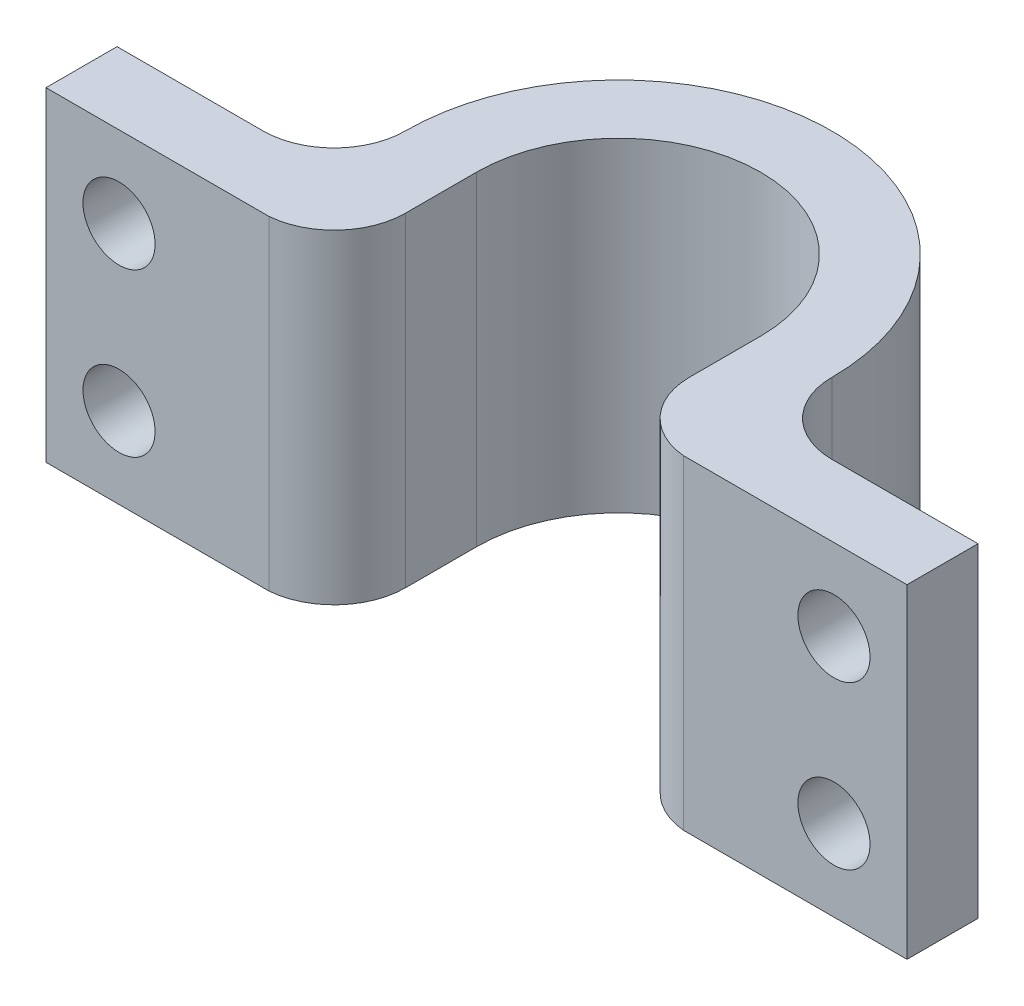
ISO-10303-21;
HEADER;
FILE_DESCRIPTION(('STEP AP214'),'2;1');
FILE_NAME('part.step','',(''),(''),'','','');
FILE_SCHEMA(('AUTOMOTIVE_DESIGN { 1 0 10303 214 1 1 1 1 }'));
ENDSEC;
DATA;
#1=APPLICATION_CONTEXT('core data for automotive mechanical design processes');
#2=APPLICATION_PROTOCOL_DEFINITION('international standard','automotive_design',2000,#1);
#3=PRODUCT_CONTEXT('',#1,'mechanical');
#4=PRODUCT('Part','Part','',(#3));
#5=PRODUCT_RELATED_PRODUCT_CATEGORY('part','',(#4));
#6=PRODUCT_DEFINITION_FORMATION('','',#4);
#7=PRODUCT_DEFINITION_CONTEXT('part definition',#1,'design');
#8=PRODUCT_DEFINITION('design','',#6,#7);
#9=PRODUCT_DEFINITION_SHAPE('','',#8);
#10=(LENGTH_UNIT() NAMED_UNIT(*) SI_UNIT(.MILLI.,.METRE.));
#11=(NAMED_UNIT(*) PLANE_ANGLE_UNIT() SI_UNIT($,.RADIAN.));
#12=(NAMED_UNIT(*) SI_UNIT($,.STERADIAN.) SOLID_ANGLE_UNIT());
#13=UNCERTAINTY_MEASURE_WITH_UNIT(LENGTH_MEASURE(1.E-05),#10,'distance_accuracy_value','');
#14=(GEOMETRIC_REPRESENTATION_CONTEXT(3) GLOBAL_UNCERTAINTY_ASSIGNED_CONTEXT((#13)) GLOBAL_UNIT_ASSIGNED_CONTEXT((#10,
#11,#12)) REPRESENTATION_CONTEXT('',''));
#15=CARTESIAN_POINT('',(0.,0.,0.));
#16=DIRECTION('',(0.,0.,1.));
#17=DIRECTION('',(1.,0.,0.));
#18=AXIS2_PLACEMENT_3D('',#15,#16,#17);
#19=CARTESIAN_POINT('',(-2.95941394430367,6.75,0.926754933966115));
#20=DIRECTION('',(0.,-1.,0.));
#21=DIRECTION('',(0.,0.,-1.));
#22=AXIS2_PLACEMENT_3D('',#19,#20,#21);
#23=CYLINDRICAL_SURFACE('',#22,0.988839731619867);
#24=CARTESIAN_POINT('',(-2.95941394430367,2.25,0.926754933966115));
#25=DIRECTION('',(0.,1.,0.));
#26=DIRECTION('',(0.,0.,-1.));
#27=AXIS2_PLACEMENT_3D('',#24,#25,#26);
#28=CIRCLE('',#27,0.988839731619867);
#29=CARTESIAN_POINT('',(-2.87704444821188,2.25,1.91215803977796));
#30=VERTEX_POINT('',#29);
#31=CARTESIAN_POINT('',(-1.9705742126838,2.25,0.926754933966115));
#32=VERTEX_POINT('',#31);
#33=EDGE_CURVE('E168',#30,#32,#28,.T.);
#34=ORIENTED_EDGE('',*,*,#33,.T.);
#35=DIRECTION('',(0.,-1.,0.));
#36=VECTOR('',#35,1.);
#37=CARTESIAN_POINT('',(-1.9705742126838,6.75,0.926754933966115));
#38=LINE('',#37,#36);
#39=CARTESIAN_POINT('',(-1.9705742126838,6.75,0.926754933966115));
#40=VERTEX_POINT('',#39);
#41=EDGE_CURVE('E11',#40,#32,#38,.T.);
#42=ORIENTED_EDGE('',*,*,#41,.F.);
#43=CARTESIAN_POINT('',(-2.95941394430367,6.75,0.926754933966115));
#44=DIRECTION('',(0.,1.,0.));
#45=DIRECTION('',(0.,0.,-1.));
#46=AXIS2_PLACEMENT_3D('',#43,#44,#45);
#47=CIRCLE('',#46,0.988839731619867);
#48=CARTESIAN_POINT('',(-2.87704444821188,6.75,1.91215803977796));
#49=VERTEX_POINT('',#48);
#50=EDGE_CURVE('E195',#49,#40,#47,.T.);
#51=ORIENTED_EDGE('',*,*,#50,.F.);
#52=DIRECTION('',(0.,-1.,0.));
#53=VECTOR('',#52,1.);
#54=CARTESIAN_POINT('',(-2.87704444821188,6.75,1.91215803977796));
#55=LINE('',#54,#53);
#56=EDGE_CURVE('E164',#49,#30,#55,.T.);
#57=ORIENTED_EDGE('',*,*,#56,.T.);
#58=EDGE_LOOP('',(#34,#42,#51,#57));
#59=FACE_BOUND('',#58,.T.);
#60=ADVANCED_FACE('F34',(#59),#23,.T.);
#61=CARTESIAN_POINT('',(-1.9705742126838,6.75,-0.0586481718457327));
#62=DIRECTION('',(-1.,0.,0.));
#63=DIRECTION('',(0.,0.,1.));
#64=AXIS2_PLACEMENT_3D('',#61,#62,#63);
#65=PLANE('',#64);
#66=DIRECTION('',(0.,0.,-1.));
#67=VECTOR('',#66,1.);
#68=CARTESIAN_POINT('',(-1.9705742126838,2.25,-0.0586481718457327));
#69=LINE('',#68,#67);
#70=CARTESIAN_POINT('',(-1.9705742126838,2.25,-0.0586481718457331));
#71=VERTEX_POINT('',#70);
#72=EDGE_CURVE('E171',#32,#71,#69,.T.);
#73=ORIENTED_EDGE('',*,*,#72,.T.);
#74=DIRECTION('',(0.,-1.,0.));
#75=VECTOR('',#74,1.);
#76=CARTESIAN_POINT('',(-1.9705742126838,6.75,-0.0586481718457331));
#77=LINE('',#76,#75);
#78=CARTESIAN_POINT('',(-1.9705742126838,6.75,-0.0586481718457331));
#79=VERTEX_POINT('',#78);
#80=EDGE_CURVE('E43',#79,#71,#77,.T.);
#81=ORIENTED_EDGE('',*,*,#80,.F.);
#82=DIRECTION('',(0.,0.,-1.));
#83=VECTOR('',#82,1.);
#84=CARTESIAN_POINT('',(-1.9705742126838,6.75,-0.0586481718457327));
#85=LINE('',#84,#83);
#86=EDGE_CURVE('E113',#40,#79,#85,.T.);
#87=ORIENTED_EDGE('',*,*,#86,.F.);
#88=ORIENTED_EDGE('',*,*,#41,.T.);
#89=EDGE_LOOP('',(#73,#81,#87,#88));
#90=FACE_BOUND('',#89,.T.);
#91=ADVANCED_FACE('F293',(#90),#65,.F.);
#92=CARTESIAN_POINT('',(-0.000574212683799921,6.75,-0.0586481718457327));
#93=DIRECTION('',(0.,-1.,0.));
#94=DIRECTION('',(0.,0.,-1.));
#95=AXIS2_PLACEMENT_3D('',#92,#93,#94);
#96=CYLINDRICAL_SURFACE('',#95,1.97);
#97=CARTESIAN_POINT('',(-0.000574212683799921,2.25,-0.0586481718457327));
#98=DIRECTION('',(0.,-1.,0.));
#99=DIRECTION('',(0.,0.,1.));
#100=AXIS2_PLACEMENT_3D('',#97,#98,#99);
#101=CIRCLE('',#100,1.97);
#102=CARTESIAN_POINT('',(1.9694257873162,2.25,-0.0586481718457327));
#103=VERTEX_POINT('',#102);
#104=EDGE_CURVE('E174',#71,#103,#101,.T.);
#105=ORIENTED_EDGE('',*,*,#104,.T.);
#106=DIRECTION('',(0.,-1.,0.));
#107=VECTOR('',#106,1.);
#108=CARTESIAN_POINT('',(1.9694257873162,6.75,-0.0586481718457327));
#109=LINE('',#108,#107);
#110=CARTESIAN_POINT('',(1.9694257873162,6.75,-0.0586481718457327));
#111=VERTEX_POINT('',#110);
#112=EDGE_CURVE('E220',#111,#103,#109,.T.);
#113=ORIENTED_EDGE('',*,*,#112,.F.);
#114=CARTESIAN_POINT('',(-0.000574212683799921,6.75,-0.0586481718457327));
#115=DIRECTION('',(0.,-1.,0.));
#116=DIRECTION('',(0.,0.,1.));
#117=AXIS2_PLACEMENT_3D('',#114,#115,#116);
#118=CIRCLE('',#117,1.97);
#119=EDGE_CURVE('E249',#79,#111,#118,.T.);
#120=ORIENTED_EDGE('',*,*,#119,.F.);
#121=ORIENTED_EDGE('',*,*,#80,.T.);
#122=EDGE_LOOP('',(#105,#113,#120,#121));
#123=FACE_BOUND('',#122,.T.);
#124=ADVANCED_FACE('F297',(#123),#96,.F.);
#125=CARTESIAN_POINT('',(1.9694257873162,6.75,-0.0586481718457327));
#126=DIRECTION('',(1.,0.,0.));
#127=DIRECTION('',(0.,0.,-1.));
#128=AXIS2_PLACEMENT_3D('',#125,#126,#127);
#129=PLANE('',#128);
#130=DIRECTION('',(0.,0.,1.));
#131=VECTOR('',#130,1.);
#132=CARTESIAN_POINT('',(1.9694257873162,2.25,-0.0586481718457327));
#133=LINE('',#132,#131);
#134=CARTESIAN_POINT('',(1.9694257873162,2.25,0.926754933966114));
#135=VERTEX_POINT('',#134);
#136=EDGE_CURVE('E176',#103,#135,#133,.T.);
#137=ORIENTED_EDGE('',*,*,#136,.T.);
#138=DIRECTION('',(0.,-1.,0.));
#139=VECTOR('',#138,1.);
#140=CARTESIAN_POINT('',(1.9694257873162,6.75,0.926754933966114));
#141=LINE('',#140,#139);
#142=CARTESIAN_POINT('',(1.9694257873162,6.75,0.926754933966114));
#143=VERTEX_POINT('',#142);
#144=EDGE_CURVE('E217',#143,#135,#141,.T.);
#145=ORIENTED_EDGE('',*,*,#144,.F.);
#146=DIRECTION('',(0.,0.,1.));
#147=VECTOR('',#146,1.);
#148=CARTESIAN_POINT('',(1.9694257873162,6.75,-0.0586481718457327));
#149=LINE('',#148,#147);
#150=EDGE_CURVE('E251',#111,#143,#149,.T.);
#151=ORIENTED_EDGE('',*,*,#150,.F.);
#152=ORIENTED_EDGE('',*,*,#112,.T.);
#153=EDGE_LOOP('',(#137,#145,#151,#152));
#154=FACE_BOUND('',#153,.T.);
#155=ADVANCED_FACE('F301',(#154),#129,.F.);
#156=CARTESIAN_POINT('',(2.95826551893607,6.75,0.926754933966114));
#157=DIRECTION('',(0.,-1.,0.));
#158=DIRECTION('',(0.,0.,-1.));
#159=AXIS2_PLACEMENT_3D('',#156,#157,#158);
#160=CYLINDRICAL_SURFACE('',#159,0.988839731619867);
#161=CARTESIAN_POINT('',(2.95826551893607,2.25,0.926754933966114));
#162=DIRECTION('',(0.,1.,0.));
#163=DIRECTION('',(0.,0.,1.));
#164=AXIS2_PLACEMENT_3D('',#161,#162,#163);
#165=CIRCLE('',#164,0.988839731619867);
#166=CARTESIAN_POINT('',(2.86676158030448,2.25,1.91135182815427));
#167=VERTEX_POINT('',#166);
#168=EDGE_CURVE('E178',#135,#167,#165,.T.);
#169=ORIENTED_EDGE('',*,*,#168,.T.);
#170=DIRECTION('',(0.,-1.,0.));
#171=VECTOR('',#170,1.);
#172=CARTESIAN_POINT('',(2.86676158030448,6.75,1.91135182815427));
#173=LINE('',#172,#171);
#174=CARTESIAN_POINT('',(2.86676158030448,6.75,1.91135182815427));
#175=VERTEX_POINT('',#174);
#176=EDGE_CURVE('E214',#175,#167,#173,.T.);
#177=ORIENTED_EDGE('',*,*,#176,.F.);
#178=CARTESIAN_POINT('',(2.95826551893607,6.75,0.926754933966114));
#179=DIRECTION('',(0.,1.,0.));
#180=DIRECTION('',(0.,0.,1.));
#181=AXIS2_PLACEMENT_3D('',#178,#179,#180);
#182=CIRCLE('',#181,0.988839731619867);
#183=EDGE_CURVE('E253',#143,#175,#182,.T.);
#184=ORIENTED_EDGE('',*,*,#183,.F.);
#185=ORIENTED_EDGE('',*,*,#144,.T.);
#186=EDGE_LOOP('',(#169,#177,#184,#185));
#187=FACE_BOUND('',#186,.T.);
#188=ADVANCED_FACE('F307',(#187),#160,.T.);
#189=CARTESIAN_POINT('',(2.86676158030448,6.75,1.91135182815427));
#190=DIRECTION('',(0.,0.,-1.));
#191=DIRECTION('',(-1.,0.,0.));
#192=AXIS2_PLACEMENT_3D('',#189,#190,#191);
#193=PLANE('',#192);
#194=CARTESIAN_POINT('',(4.95654720603206,3.375,1.91135182815427));
#195=DIRECTION('',(0.,0.,-1.));
#196=DIRECTION('',(-1.,0.,0.));
#197=AXIS2_PLACEMENT_3D('',#194,#195,#196);
#198=CIRCLE('',#197,0.500000000000001);
#199=CARTESIAN_POINT('',(4.45654720603206,3.375,1.91135182815427));
#200=VERTEX_POINT('',#199);
#201=EDGE_CURVE('E172',#200,#200,#198,.T.);
#202=ORIENTED_EDGE('',*,*,#201,.T.);
#203=EDGE_LOOP('',(#202));
#204=FACE_BOUND('',#203,.T.);
#205=CARTESIAN_POINT('',(4.95654720603206,5.625,1.91135182815427));
#206=DIRECTION('',(0.,0.,-1.));
#207=DIRECTION('',(-1.,0.,0.));
#208=AXIS2_PLACEMENT_3D('',#205,#206,#207);
#209=CIRCLE('',#208,0.500000000000001);
#210=CARTESIAN_POINT('',(4.45654720603206,5.625,1.91135182815427));
#211=VERTEX_POINT('',#210);
#212=EDGE_CURVE('E230',#211,#211,#209,.T.);
#213=ORIENTED_EDGE('',*,*,#212,.T.);
#214=EDGE_LOOP('',(#213));
#215=FACE_BOUND('',#214,.T.);
#216=DIRECTION('',(1.,0.,0.));
#217=VECTOR('',#216,1.);
#218=CARTESIAN_POINT('',(2.86676158030448,2.25,1.91135182815427));
#219=LINE('',#218,#217);
#220=CARTESIAN_POINT('',(5.9694257873162,2.25,1.91135182815427));
#221=VERTEX_POINT('',#220);
#222=EDGE_CURVE('E180',#167,#221,#219,.T.);
#223=ORIENTED_EDGE('',*,*,#222,.T.);
#224=DIRECTION('',(0.,-1.,0.));
#225=VECTOR('',#224,1.);
#226=CARTESIAN_POINT('',(5.9694257873162,6.75,1.91135182815427));
#227=LINE('',#226,#225);
#228=CARTESIAN_POINT('',(5.9694257873162,6.75,1.91135182815427));
#229=VERTEX_POINT('',#228);
#230=EDGE_CURVE('E211',#229,#221,#227,.T.);
#231=ORIENTED_EDGE('',*,*,#230,.F.);
#232=DIRECTION('',(1.,0.,0.));
#233=VECTOR('',#232,1.);
#234=CARTESIAN_POINT('',(2.86676158030448,6.75,1.91135182815427));
#235=LINE('',#234,#233);
#236=EDGE_CURVE('E255',#175,#229,#235,.T.);
#237=ORIENTED_EDGE('',*,*,#236,.F.);
#238=ORIENTED_EDGE('',*,*,#176,.T.);
#239=EDGE_LOOP('',(#223,#231,#237,#238));
#240=FACE_BOUND('',#239,.T.);
#241=ADVANCED_FACE('F311',(#204,#215,#240),#193,.F.);
#242=CARTESIAN_POINT('',(5.9694257873162,6.75,1.91135182815427));
#243=DIRECTION('',(-1.,0.,0.));
#244=DIRECTION('',(0.,0.,1.));
#245=AXIS2_PLACEMENT_3D('',#242,#243,#244);
#246=PLANE('',#245);
#247=DIRECTION('',(0.,0.,-1.));
#248=VECTOR('',#247,1.);
#249=CARTESIAN_POINT('',(5.9694257873162,2.25,1.91135182815427));
#250=LINE('',#249,#248);
#251=CARTESIAN_POINT('',(5.9694257873162,2.25,0.926754933966114));
#252=VERTEX_POINT('',#251);
#253=EDGE_CURVE('E182',#221,#252,#250,.T.);
#254=ORIENTED_EDGE('',*,*,#253,.T.);
#255=DIRECTION('',(0.,-1.,0.));
#256=VECTOR('',#255,1.);
#257=CARTESIAN_POINT('',(5.9694257873162,6.75,0.926754933966114));
#258=LINE('',#257,#256);
#259=CARTESIAN_POINT('',(5.9694257873162,6.75,0.926754933966114));
#260=VERTEX_POINT('',#259);
#261=EDGE_CURVE('E208',#260,#252,#258,.T.);
#262=ORIENTED_EDGE('',*,*,#261,.F.);
#263=DIRECTION('',(0.,0.,-1.));
#264=VECTOR('',#263,1.);
#265=CARTESIAN_POINT('',(5.9694257873162,6.75,1.91135182815427));
#266=LINE('',#265,#264);
#267=EDGE_CURVE('E257',#229,#260,#266,.T.);
#268=ORIENTED_EDGE('',*,*,#267,.F.);
#269=ORIENTED_EDGE('',*,*,#230,.T.);
#270=EDGE_LOOP('',(#254,#262,#268,#269));
#271=FACE_BOUND('',#270,.T.);
#272=ADVANCED_FACE('F315',(#271),#246,.F.);
#273=CARTESIAN_POINT('',(5.9694257873162,6.75,0.926754933966114));
#274=DIRECTION('',(0.,0.,1.));
#275=DIRECTION('',(1.,0.,0.));
#276=AXIS2_PLACEMENT_3D('',#273,#274,#275);
#277=PLANE('',#276);
#278=CARTESIAN_POINT('',(4.95654720603206,3.375,0.926754933966115));
#279=DIRECTION('',(0.,0.,-1.));
#280=DIRECTION('',(-1.,0.,0.));
#281=AXIS2_PLACEMENT_3D('',#278,#279,#280);
#282=CIRCLE('',#281,0.500000000000001);
#283=CARTESIAN_POINT('',(4.45654720603206,3.375,0.926754933966115));
#284=VERTEX_POINT('',#283);
#285=EDGE_CURVE('E232',#284,#284,#282,.T.);
#286=ORIENTED_EDGE('',*,*,#285,.F.);
#287=EDGE_LOOP('',(#286));
#288=FACE_BOUND('',#287,.T.);
#289=CARTESIAN_POINT('',(4.95654720603206,5.625,0.926754933966115));
#290=DIRECTION('',(0.,0.,-1.));
#291=DIRECTION('',(-1.,0.,0.));
#292=AXIS2_PLACEMENT_3D('',#289,#290,#291);
#293=CIRCLE('',#292,0.500000000000001);
#294=CARTESIAN_POINT('',(4.45654720603206,5.625,0.926754933966115));
#295=VERTEX_POINT('',#294);
#296=EDGE_CURVE('E226',#295,#295,#293,.T.);
#297=ORIENTED_EDGE('',*,*,#296,.F.);
#298=EDGE_LOOP('',(#297));
#299=FACE_BOUND('',#298,.T.);
#300=DIRECTION('',(-1.,0.,0.));
#301=VECTOR('',#300,1.);
#302=CARTESIAN_POINT('',(5.9694257873162,2.25,0.926754933966114));
#303=LINE('',#302,#301);
#304=CARTESIAN_POINT('',(3.94366862474791,2.25,0.926754933966115));
#305=VERTEX_POINT('',#304);
#306=EDGE_CURVE('E184',#252,#305,#303,.T.);
#307=ORIENTED_EDGE('',*,*,#306,.T.);
#308=DIRECTION('',(0.,-1.,0.));
#309=VECTOR('',#308,1.);
#310=CARTESIAN_POINT('',(3.94366862474791,6.75,0.926754933966115));
#311=LINE('',#310,#309);
#312=CARTESIAN_POINT('',(3.94366862474791,6.75,0.926754933966115));
#313=VERTEX_POINT('',#312);
#314=EDGE_CURVE('E205',#313,#305,#311,.T.);
#315=ORIENTED_EDGE('',*,*,#314,.F.);
#316=DIRECTION('',(-1.,0.,0.));
#317=VECTOR('',#316,1.);
#318=CARTESIAN_POINT('',(5.9694257873162,6.75,0.926754933966114));
#319=LINE('',#318,#317);
#320=EDGE_CURVE('E259',#260,#313,#319,.T.);
#321=ORIENTED_EDGE('',*,*,#320,.F.);
#322=ORIENTED_EDGE('',*,*,#261,.T.);
#323=EDGE_LOOP('',(#307,#315,#321,#322));
#324=FACE_BOUND('',#323,.T.);
#325=ADVANCED_FACE('F319',(#288,#299,#324),#277,.F.);
#326=CARTESIAN_POINT('',(3.94366862474791,6.75,-0.0586481718457336));
#327=DIRECTION('',(0.,-1.,0.));
#328=DIRECTION('',(0.,0.,-1.));
#329=AXIS2_PLACEMENT_3D('',#326,#327,#328);
#330=CYLINDRICAL_SURFACE('',#329,0.985403105811848);
#331=CARTESIAN_POINT('',(3.94366862474791,2.25,-0.0586481718457336));
#332=DIRECTION('',(0.,-1.,0.));
#333=DIRECTION('',(0.,0.,1.));
#334=AXIS2_PLACEMENT_3D('',#331,#332,#333);
#335=CIRCLE('',#334,0.985403105811848);
#336=CARTESIAN_POINT('',(2.95826551893607,2.25,-0.0586481718457325));
#337=VERTEX_POINT('',#336);
#338=EDGE_CURVE('E186',#305,#337,#335,.T.);
#339=ORIENTED_EDGE('',*,*,#338,.T.);
#340=DIRECTION('',(0.,-1.,0.));
#341=VECTOR('',#340,1.);
#342=CARTESIAN_POINT('',(2.95826551893607,6.75,-0.0586481718457325));
#343=LINE('',#342,#341);
#344=CARTESIAN_POINT('',(2.95826551893607,6.75,-0.0586481718457325));
#345=VERTEX_POINT('',#344);
#346=EDGE_CURVE('E202',#345,#337,#343,.T.);
#347=ORIENTED_EDGE('',*,*,#346,.F.);
#348=CARTESIAN_POINT('',(3.94366862474791,6.75,-0.0586481718457336));
#349=DIRECTION('',(0.,-1.,0.));
#350=DIRECTION('',(0.,0.,1.));
#351=AXIS2_PLACEMENT_3D('',#348,#349,#350);
#352=CIRCLE('',#351,0.985403105811848);
#353=EDGE_CURVE('E261',#313,#345,#352,.T.);
#354=ORIENTED_EDGE('',*,*,#353,.F.);
#355=ORIENTED_EDGE('',*,*,#314,.T.);
#356=EDGE_LOOP('',(#339,#347,#354,#355));
#357=FACE_BOUND('',#356,.T.);
#358=ADVANCED_FACE('F323',(#357),#330,.F.);
#359=CARTESIAN_POINT('',(-0.000574212683799921,6.75,-0.0586481718457327));
#360=DIRECTION('',(0.,-1.,0.));
#361=DIRECTION('',(0.,0.,-1.));
#362=AXIS2_PLACEMENT_3D('',#359,#360,#361);
#363=CYLINDRICAL_SURFACE('',#362,2.95883973161987);
#364=CARTESIAN_POINT('',(-0.000574212683799921,2.25,-0.0586481718457327));
#365=DIRECTION('',(0.,1.,0.));
#366=DIRECTION('',(0.,0.,1.));
#367=AXIS2_PLACEMENT_3D('',#364,#365,#366);
#368=CIRCLE('',#367,2.95883973161987);
#369=CARTESIAN_POINT('',(-2.95941394430367,2.25,-0.0586481718457328));
#370=VERTEX_POINT('',#369);
#371=EDGE_CURVE('E188',#337,#370,#368,.T.);
#372=ORIENTED_EDGE('',*,*,#371,.T.);
#373=DIRECTION('',(0.,-1.,0.));
#374=VECTOR('',#373,1.);
#375=CARTESIAN_POINT('',(-2.95941394430367,6.75,-0.0586481718457328));
#376=LINE('',#375,#374);
#377=CARTESIAN_POINT('',(-2.95941394430367,6.75,-0.0586481718457328));
#378=VERTEX_POINT('',#377);
#379=EDGE_CURVE('E199',#378,#370,#376,.T.);
#380=ORIENTED_EDGE('',*,*,#379,.F.);
#381=CARTESIAN_POINT('',(-0.000574212683799921,6.75,-0.0586481718457327));
#382=DIRECTION('',(0.,1.,0.));
#383=DIRECTION('',(0.,0.,1.));
#384=AXIS2_PLACEMENT_3D('',#381,#382,#383);
#385=CIRCLE('',#384,2.95883973161987);
#386=EDGE_CURVE('E263',#345,#378,#385,.T.);
#387=ORIENTED_EDGE('',*,*,#386,.F.);
#388=ORIENTED_EDGE('',*,*,#346,.T.);
#389=EDGE_LOOP('',(#372,#380,#387,#388));
#390=FACE_BOUND('',#389,.T.);
#391=ADVANCED_FACE('F269',(#390),#363,.T.);
#392=CARTESIAN_POINT('',(-3.94481705011551,6.75,-0.0586481718457336));
#393=DIRECTION('',(0.,-1.,0.));
#394=DIRECTION('',(0.,0.,-1.));
#395=AXIS2_PLACEMENT_3D('',#392,#393,#394);
#396=CYLINDRICAL_SURFACE('',#395,0.985403105811848);
#397=CARTESIAN_POINT('',(-3.94481705011551,2.25,-0.0586481718457336));
#398=DIRECTION('',(0.,-1.,0.));
#399=DIRECTION('',(0.,0.,-1.));
#400=AXIS2_PLACEMENT_3D('',#397,#398,#399);
#401=CIRCLE('',#400,0.985403105811848);
#402=CARTESIAN_POINT('',(-3.94481705011551,2.25,0.926754933966115));
#403=VERTEX_POINT('',#402);
#404=EDGE_CURVE('E190',#370,#403,#401,.T.);
#405=ORIENTED_EDGE('',*,*,#404,.T.);
#406=DIRECTION('',(0.,-1.,0.));
#407=VECTOR('',#406,1.);
#408=CARTESIAN_POINT('',(-3.94481705011551,6.75,0.926754933966115));
#409=LINE('',#408,#407);
#410=CARTESIAN_POINT('',(-3.94481705011551,6.75,0.926754933966115));
#411=VERTEX_POINT('',#410);
#412=EDGE_CURVE('E159',#411,#403,#409,.T.);
#413=ORIENTED_EDGE('',*,*,#412,.F.);
#414=CARTESIAN_POINT('',(-3.94481705011551,6.75,-0.0586481718457336));
#415=DIRECTION('',(0.,-1.,0.));
#416=DIRECTION('',(0.,0.,-1.));
#417=AXIS2_PLACEMENT_3D('',#414,#415,#416);
#418=CIRCLE('',#417,0.985403105811848);
#419=EDGE_CURVE('E150',#378,#411,#418,.T.);
#420=ORIENTED_EDGE('',*,*,#419,.F.);
#421=ORIENTED_EDGE('',*,*,#379,.T.);
#422=EDGE_LOOP('',(#405,#413,#420,#421));
#423=FACE_BOUND('',#422,.T.);
#424=ADVANCED_FACE('F273',(#423),#396,.F.);
#425=CARTESIAN_POINT('',(-5.9705742126838,6.75,0.926754933966115));
#426=DIRECTION('',(0.,0.,1.));
#427=DIRECTION('',(1.,0.,0.));
#428=AXIS2_PLACEMENT_3D('',#425,#426,#427);
#429=PLANE('',#428);
#430=CARTESIAN_POINT('',(-4.95769563139966,5.625,0.926754933966115));
#431=DIRECTION('',(0.,0.,-1.));
#432=DIRECTION('',(1.,0.,0.));
#433=AXIS2_PLACEMENT_3D('',#430,#431,#432);
#434=CIRCLE('',#433,0.500000000000001);
#435=CARTESIAN_POINT('',(-4.45769563139966,5.625,0.926754933966115));
#436=VERTEX_POINT('',#435);
#437=EDGE_CURVE('E241',#436,#436,#434,.T.);
#438=ORIENTED_EDGE('',*,*,#437,.F.);
#439=EDGE_LOOP('',(#438));
#440=FACE_BOUND('',#439,.T.);
#441=CARTESIAN_POINT('',(-4.95769563139966,3.375,0.926754933966115));
#442=DIRECTION('',(0.,0.,-1.));
#443=DIRECTION('',(1.,0.,0.));
#444=AXIS2_PLACEMENT_3D('',#441,#442,#443);
#445=CIRCLE('',#444,0.500000000000001);
#446=CARTESIAN_POINT('',(-4.45769563139966,3.375,0.926754933966115));
#447=VERTEX_POINT('',#446);
#448=EDGE_CURVE('E237',#447,#447,#445,.T.);
#449=ORIENTED_EDGE('',*,*,#448,.F.);
#450=EDGE_LOOP('',(#449));
#451=FACE_BOUND('',#450,.T.);
#452=DIRECTION('',(-1.,0.,0.));
#453=VECTOR('',#452,1.);
#454=CARTESIAN_POINT('',(-5.9705742126838,2.25,0.926754933966115));
#455=LINE('',#454,#453);
#456=CARTESIAN_POINT('',(-5.9705742126838,2.25,0.926754933966115));
#457=VERTEX_POINT('',#456);
#458=EDGE_CURVE('E158',#403,#457,#455,.T.);
#459=ORIENTED_EDGE('',*,*,#458,.T.);
#460=DIRECTION('',(0.,-1.,0.));
#461=VECTOR('',#460,1.);
#462=CARTESIAN_POINT('',(-5.9705742126838,6.75,0.926754933966115));
#463=LINE('',#462,#461);
#464=CARTESIAN_POINT('',(-5.9705742126838,6.75,0.926754933966115));
#465=VERTEX_POINT('',#464);
#466=EDGE_CURVE('E155',#465,#457,#463,.T.);
#467=ORIENTED_EDGE('',*,*,#466,.F.);
#468=DIRECTION('',(-1.,0.,0.));
#469=VECTOR('',#468,1.);
#470=CARTESIAN_POINT('',(-5.9705742126838,6.75,0.926754933966115));
#471=LINE('',#470,#469);
#472=EDGE_CURVE('E144',#411,#465,#471,.T.);
#473=ORIENTED_EDGE('',*,*,#472,.F.);
#474=ORIENTED_EDGE('',*,*,#412,.T.);
#475=EDGE_LOOP('',(#459,#467,#473,#474));
#476=FACE_BOUND('',#475,.T.);
#477=ADVANCED_FACE('F156',(#440,#451,#476),#429,.F.);
#478=CARTESIAN_POINT('',(-5.9705742126838,6.75,1.91215803977796));
#479=DIRECTION('',(1.,0.,0.));
#480=DIRECTION('',(0.,0.,-1.));
#481=AXIS2_PLACEMENT_3D('',#478,#479,#480);
#482=PLANE('',#481);
#483=DIRECTION('',(0.,0.,1.));
#484=VECTOR('',#483,1.);
#485=CARTESIAN_POINT('',(-5.9705742126838,2.25,1.91215803977796));
#486=LINE('',#485,#484);
#487=CARTESIAN_POINT('',(-5.9705742126838,2.25,1.91215803977796));
#488=VERTEX_POINT('',#487);
#489=EDGE_CURVE('E99',#457,#488,#486,.T.);
#490=ORIENTED_EDGE('',*,*,#489,.T.);
#491=DIRECTION('',(0.,-1.,0.));
#492=VECTOR('',#491,1.);
#493=CARTESIAN_POINT('',(-5.9705742126838,6.75,1.91215803977796));
#494=LINE('',#493,#492);
#495=CARTESIAN_POINT('',(-5.9705742126838,6.75,1.91215803977796));
#496=VERTEX_POINT('',#495);
#497=EDGE_CURVE('E160',#496,#488,#494,.T.);
#498=ORIENTED_EDGE('',*,*,#497,.F.);
#499=DIRECTION('',(0.,0.,1.));
#500=VECTOR('',#499,1.);
#501=CARTESIAN_POINT('',(-5.9705742126838,6.75,1.91215803977796));
#502=LINE('',#501,#500);
#503=EDGE_CURVE('E148',#465,#496,#502,.T.);
#504=ORIENTED_EDGE('',*,*,#503,.F.);
#505=ORIENTED_EDGE('',*,*,#466,.T.);
#506=EDGE_LOOP('',(#490,#498,#504,#505));
#507=FACE_BOUND('',#506,.T.);
#508=ADVANCED_FACE('F162',(#507),#482,.F.);
#509=CARTESIAN_POINT('',(-2.87704444821188,6.75,1.91215803977796));
#510=DIRECTION('',(0.,0.,-1.));
#511=DIRECTION('',(-1.,0.,0.));
#512=AXIS2_PLACEMENT_3D('',#509,#510,#511);
#513=PLANE('',#512);
#514=CARTESIAN_POINT('',(-4.95769563139966,5.625,1.91215803977796));
#515=DIRECTION('',(0.,0.,-1.));
#516=DIRECTION('',(-1.,0.,0.));
#517=AXIS2_PLACEMENT_3D('',#514,#515,#516);
#518=CIRCLE('',#517,0.500000000000001);
#519=CARTESIAN_POINT('',(-5.45769563139966,5.625,1.91215803977796));
#520=VERTEX_POINT('',#519);
#521=EDGE_CURVE('E37',#520,#520,#518,.T.);
#522=ORIENTED_EDGE('',*,*,#521,.T.);
#523=EDGE_LOOP('',(#522));
#524=FACE_BOUND('',#523,.T.);
#525=CARTESIAN_POINT('',(-4.95769563139966,3.375,1.91215803977796));
#526=DIRECTION('',(0.,0.,-1.));
#527=DIRECTION('',(-1.,0.,0.));
#528=AXIS2_PLACEMENT_3D('',#525,#526,#527);
#529=CIRCLE('',#528,0.500000000000001);
#530=CARTESIAN_POINT('',(-5.45769563139966,3.375,1.91215803977796));
#531=VERTEX_POINT('',#530);
#532=EDGE_CURVE('E224',#531,#531,#529,.T.);
#533=ORIENTED_EDGE('',*,*,#532,.T.);
#534=EDGE_LOOP('',(#533));
#535=FACE_BOUND('',#534,.T.);
#536=DIRECTION('',(1.,0.,0.));
#537=VECTOR('',#536,1.);
#538=CARTESIAN_POINT('',(-2.87704444821188,2.25,1.91215803977796));
#539=LINE('',#538,#537);
#540=EDGE_CURVE('E105',#488,#30,#539,.T.);
#541=ORIENTED_EDGE('',*,*,#540,.T.);
#542=ORIENTED_EDGE('',*,*,#56,.F.);
#543=DIRECTION('',(1.,0.,0.));
#544=VECTOR('',#543,1.);
#545=CARTESIAN_POINT('',(-2.87704444821188,6.75,1.91215803977796));
#546=LINE('',#545,#544);
#547=EDGE_CURVE('E52',#496,#49,#546,.T.);
#548=ORIENTED_EDGE('',*,*,#547,.F.);
#549=ORIENTED_EDGE('',*,*,#497,.T.);
#550=EDGE_LOOP('',(#541,#542,#548,#549));
#551=FACE_BOUND('',#550,.T.);
#552=ADVANCED_FACE('F281',(#524,#535,#551),#513,.F.);
#553=CARTESIAN_POINT('',(-2.95941394430367,6.75,0.926754933966115));
#554=DIRECTION('',(0.,-1.,0.));
#555=DIRECTION('',(0.,0.,-1.));
#556=AXIS2_PLACEMENT_3D('',#553,#554,#555);
#557=PLANE('',#556);
#558=ORIENTED_EDGE('',*,*,#50,.T.);
#559=ORIENTED_EDGE('',*,*,#86,.T.);
#560=ORIENTED_EDGE('',*,*,#119,.T.);
#561=ORIENTED_EDGE('',*,*,#150,.T.);
#562=ORIENTED_EDGE('',*,*,#183,.T.);
#563=ORIENTED_EDGE('',*,*,#236,.T.);
#564=ORIENTED_EDGE('',*,*,#267,.T.);
#565=ORIENTED_EDGE('',*,*,#320,.T.);
#566=ORIENTED_EDGE('',*,*,#353,.T.);
#567=ORIENTED_EDGE('',*,*,#386,.T.);
#568=ORIENTED_EDGE('',*,*,#419,.T.);
#569=ORIENTED_EDGE('',*,*,#472,.T.);
#570=ORIENTED_EDGE('',*,*,#503,.T.);
#571=ORIENTED_EDGE('',*,*,#547,.T.);
#572=EDGE_LOOP('',(#558,#559,#560,#561,#562,#563,#564,#565,#566,#567,#568,#569,#570,#571));
#573=FACE_BOUND('',#572,.T.);
#574=ADVANCED_FACE('F146',(#573),#557,.F.);
#575=CARTESIAN_POINT('',(-2.95941394430367,2.25,0.926754933966115));
#576=DIRECTION('',(0.,-1.,0.));
#577=DIRECTION('',(0.,0.,-1.));
#578=AXIS2_PLACEMENT_3D('',#575,#576,#577);
#579=PLANE('',#578);
#580=ORIENTED_EDGE('',*,*,#33,.F.);
#581=ORIENTED_EDGE('',*,*,#540,.F.);
#582=ORIENTED_EDGE('',*,*,#489,.F.);
#583=ORIENTED_EDGE('',*,*,#458,.F.);
#584=ORIENTED_EDGE('',*,*,#404,.F.);
#585=ORIENTED_EDGE('',*,*,#371,.F.);
#586=ORIENTED_EDGE('',*,*,#338,.F.);
#587=ORIENTED_EDGE('',*,*,#306,.F.);
#588=ORIENTED_EDGE('',*,*,#253,.F.);
#589=ORIENTED_EDGE('',*,*,#222,.F.);
#590=ORIENTED_EDGE('',*,*,#168,.F.);
#591=ORIENTED_EDGE('',*,*,#136,.F.);
#592=ORIENTED_EDGE('',*,*,#104,.F.);
#593=ORIENTED_EDGE('',*,*,#72,.F.);
#594=EDGE_LOOP('',(#580,#581,#582,#583,#584,#585,#586,#587,#588,#589,#590,#591,#592,#593));
#595=FACE_BOUND('',#594,.T.);
#596=ADVANCED_FACE('F276',(#595),#579,.T.);
#597=CARTESIAN_POINT('',(-4.95769563139966,3.375,5.42675493396611));
#598=DIRECTION('',(0.,0.,-1.));
#599=DIRECTION('',(-1.,0.,0.));
#600=AXIS2_PLACEMENT_3D('',#597,#598,#599);
#601=CYLINDRICAL_SURFACE('',#600,0.500000000000001);
#602=ORIENTED_EDGE('',*,*,#448,.T.);
#603=EDGE_LOOP('',(#602));
#604=FACE_BOUND('',#603,.T.);
#605=ORIENTED_EDGE('',*,*,#532,.F.);
#606=EDGE_LOOP('',(#605));
#607=FACE_BOUND('',#606,.T.);
#608=ADVANCED_FACE('F347',(#604,#607),#601,.F.);
#609=CARTESIAN_POINT('',(-4.95769563139966,5.625,5.42675493396611));
#610=DIRECTION('',(0.,0.,-1.));
#611=DIRECTION('',(-1.,0.,0.));
#612=AXIS2_PLACEMENT_3D('',#609,#610,#611);
#613=CYLINDRICAL_SURFACE('',#612,0.500000000000001);
#614=ORIENTED_EDGE('',*,*,#437,.T.);
#615=EDGE_LOOP('',(#614));
#616=FACE_BOUND('',#615,.T.);
#617=ORIENTED_EDGE('',*,*,#521,.F.);
#618=EDGE_LOOP('',(#617));
#619=FACE_BOUND('',#618,.T.);
#620=ADVANCED_FACE('F343',(#616,#619),#613,.F.);
#621=CARTESIAN_POINT('',(4.95654720603206,5.625,5.42675493396611));
#622=DIRECTION('',(0.,0.,-1.));
#623=DIRECTION('',(-1.,0.,0.));
#624=AXIS2_PLACEMENT_3D('',#621,#622,#623);
#625=CYLINDRICAL_SURFACE('',#624,0.500000000000001);
#626=ORIENTED_EDGE('',*,*,#296,.T.);
#627=EDGE_LOOP('',(#626));
#628=FACE_BOUND('',#627,.T.);
#629=ORIENTED_EDGE('',*,*,#212,.F.);
#630=EDGE_LOOP('',(#629));
#631=FACE_BOUND('',#630,.T.);
#632=ADVANCED_FACE('F346',(#628,#631),#625,.F.);
#633=CARTESIAN_POINT('',(4.95654720603206,3.375,5.42675493396611));
#634=DIRECTION('',(0.,0.,-1.));
#635=DIRECTION('',(-1.,0.,0.));
#636=AXIS2_PLACEMENT_3D('',#633,#634,#635);
#637=CYLINDRICAL_SURFACE('',#636,0.500000000000001);
#638=ORIENTED_EDGE('',*,*,#285,.T.);
#639=EDGE_LOOP('',(#638));
#640=FACE_BOUND('',#639,.T.);
#641=ORIENTED_EDGE('',*,*,#201,.F.);
#642=EDGE_LOOP('',(#641));
#643=FACE_BOUND('',#642,.T.);
#644=ADVANCED_FACE('F354',(#640,#643),#637,.F.);
#645=CLOSED_SHELL('',(#60,#91,#124,#155,#188,#241,#272,#325,#358,#391,#424,#477,#508,#552,#574,
#596,#608,#620,#632,#644));
#646=MANIFOLD_SOLID_BREP('B2',#645);
#647=ADVANCED_BREP_SHAPE_REPRESENTATION('',(#18,#646),#14);
#648=SHAPE_DEFINITION_REPRESENTATION(#9,#647);
ENDSEC;
END-ISO-10303-21;
